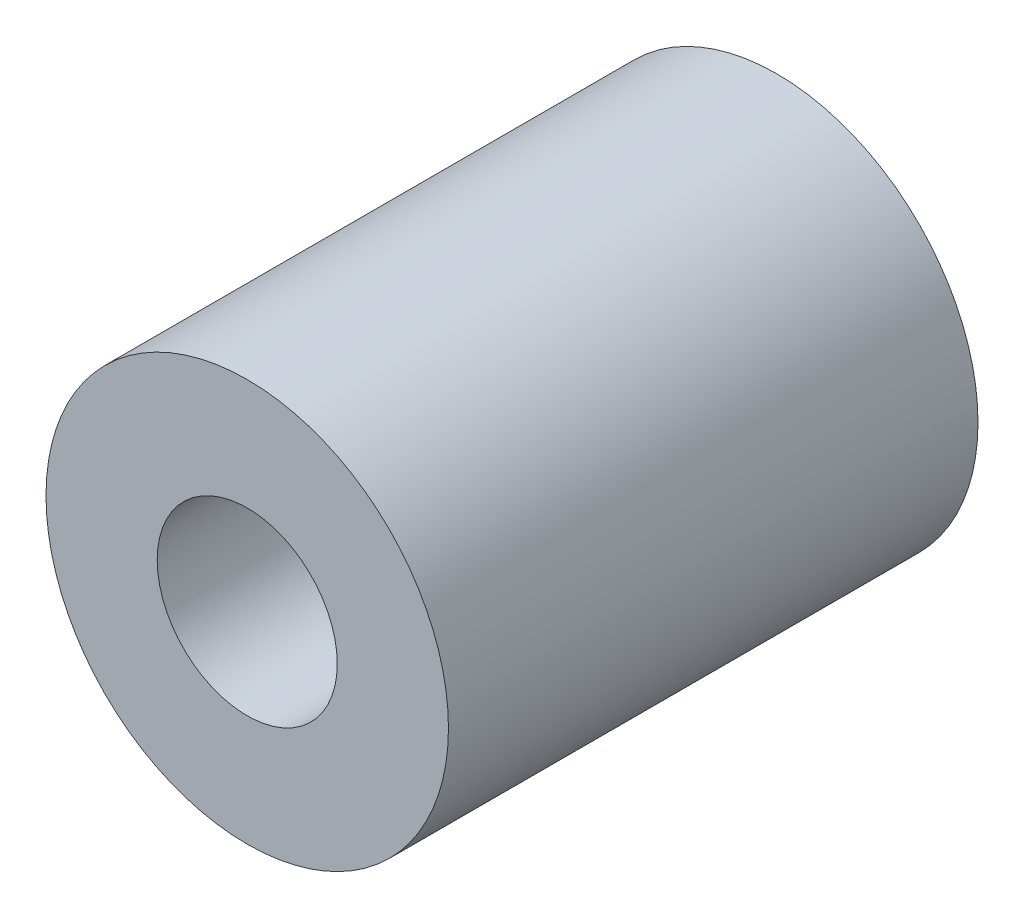
ISO-10303-21;
HEADER;
FILE_DESCRIPTION(('STEP AP214'),'2;1');
FILE_NAME('part.step','',(''),(''),'','','');
FILE_SCHEMA(('AUTOMOTIVE_DESIGN { 1 0 10303 214 1 1 1 1 }'));
ENDSEC;
DATA;
#1=APPLICATION_CONTEXT('core data for automotive mechanical design processes');
#2=APPLICATION_PROTOCOL_DEFINITION('international standard','automotive_design',2000,#1);
#3=PRODUCT_CONTEXT('',#1,'mechanical');
#4=PRODUCT('Part','Part','',(#3));
#5=PRODUCT_RELATED_PRODUCT_CATEGORY('part','',(#4));
#6=PRODUCT_DEFINITION_FORMATION('','',#4);
#7=PRODUCT_DEFINITION_CONTEXT('part definition',#1,'design');
#8=PRODUCT_DEFINITION('design','',#6,#7);
#9=PRODUCT_DEFINITION_SHAPE('','',#8);
#10=(LENGTH_UNIT() NAMED_UNIT(*) SI_UNIT(.MILLI.,.METRE.));
#11=(NAMED_UNIT(*) PLANE_ANGLE_UNIT() SI_UNIT($,.RADIAN.));
#12=(NAMED_UNIT(*) SI_UNIT($,.STERADIAN.) SOLID_ANGLE_UNIT());
#13=UNCERTAINTY_MEASURE_WITH_UNIT(LENGTH_MEASURE(1.E-05),#10,'distance_accuracy_value','');
#14=(GEOMETRIC_REPRESENTATION_CONTEXT(3) GLOBAL_UNCERTAINTY_ASSIGNED_CONTEXT((#13)) GLOBAL_UNIT_ASSIGNED_CONTEXT((#10,
#11,#12)) REPRESENTATION_CONTEXT('',''));
#15=CARTESIAN_POINT('',(0.,0.,0.));
#16=DIRECTION('',(0.,0.,1.));
#17=DIRECTION('',(1.,0.,0.));
#18=AXIS2_PLACEMENT_3D('',#15,#16,#17);
#19=CARTESIAN_POINT('',(0.,0.,25.));
#20=DIRECTION('',(0.,0.,-1.));
#21=DIRECTION('',(-1.,0.,0.));
#22=AXIS2_PLACEMENT_3D('',#19,#20,#21);
#23=CYLINDRICAL_SURFACE('',#22,9.5);
#24=CARTESIAN_POINT('',(0.,0.,25.));
#25=DIRECTION('',(0.,0.,1.));
#26=DIRECTION('',(1.,0.,0.));
#27=AXIS2_PLACEMENT_3D('',#24,#25,#26);
#28=CIRCLE('',#27,9.5);
#29=CARTESIAN_POINT('',(9.5,0.,25.));
#30=VERTEX_POINT('',#29);
#31=EDGE_CURVE('E10',#30,#30,#28,.T.);
#32=ORIENTED_EDGE('',*,*,#31,.F.);
#33=EDGE_LOOP('',(#32));
#34=FACE_BOUND('',#33,.T.);
#35=CARTESIAN_POINT('',(0.,0.,0.));
#36=DIRECTION('',(0.,0.,1.));
#37=DIRECTION('',(1.,0.,0.));
#38=AXIS2_PLACEMENT_3D('',#35,#36,#37);
#39=CIRCLE('',#38,9.5);
#40=CARTESIAN_POINT('',(9.5,0.,0.));
#41=VERTEX_POINT('',#40);
#42=EDGE_CURVE('E35',#41,#41,#39,.T.);
#43=ORIENTED_EDGE('',*,*,#42,.T.);
#44=EDGE_LOOP('',(#43));
#45=FACE_BOUND('',#44,.T.);
#46=ADVANCED_FACE('F32',(#34,#45),#23,.T.);
#47=CARTESIAN_POINT('',(0.,0.,25.));
#48=DIRECTION('',(0.,0.,1.));
#49=DIRECTION('',(1.,0.,0.));
#50=AXIS2_PLACEMENT_3D('',#47,#48,#49);
#51=PLANE('',#50);
#52=CARTESIAN_POINT('',(0.,0.,25.));
#53=DIRECTION('',(0.,0.,1.));
#54=DIRECTION('',(1.,0.,0.));
#55=AXIS2_PLACEMENT_3D('',#52,#53,#54);
#56=CIRCLE('',#55,4.25);
#57=CARTESIAN_POINT('',(4.25,0.,25.));
#58=VERTEX_POINT('',#57);
#59=EDGE_CURVE('E44',#58,#58,#56,.T.);
#60=ORIENTED_EDGE('',*,*,#59,.F.);
#61=EDGE_LOOP('',(#60));
#62=FACE_BOUND('',#61,.T.);
#63=ORIENTED_EDGE('',*,*,#31,.T.);
#64=EDGE_LOOP('',(#63));
#65=FACE_BOUND('',#64,.T.);
#66=ADVANCED_FACE('F59',(#62,#65),#51,.T.);
#67=CARTESIAN_POINT('',(0.,0.,0.));
#68=DIRECTION('',(0.,0.,1.));
#69=DIRECTION('',(1.,0.,0.));
#70=AXIS2_PLACEMENT_3D('',#67,#68,#69);
#71=PLANE('',#70);
#72=CARTESIAN_POINT('',(0.,0.,0.));
#73=DIRECTION('',(0.,0.,1.));
#74=DIRECTION('',(1.,0.,0.));
#75=AXIS2_PLACEMENT_3D('',#72,#73,#74);
#76=CIRCLE('',#75,4.25);
#77=CARTESIAN_POINT('',(4.25,0.,0.));
#78=VERTEX_POINT('',#77);
#79=EDGE_CURVE('E42',#78,#78,#76,.T.);
#80=ORIENTED_EDGE('',*,*,#79,.T.);
#81=EDGE_LOOP('',(#80));
#82=FACE_BOUND('',#81,.T.);
#83=ORIENTED_EDGE('',*,*,#42,.F.);
#84=EDGE_LOOP('',(#83));
#85=FACE_BOUND('',#84,.T.);
#86=ADVANCED_FACE('F50',(#82,#85),#71,.F.);
#87=CARTESIAN_POINT('',(0.,0.,0.));
#88=DIRECTION('',(0.,0.,1.));
#89=DIRECTION('',(1.,0.,0.));
#90=AXIS2_PLACEMENT_3D('',#87,#88,#89);
#91=CYLINDRICAL_SURFACE('',#90,4.25);
#92=ORIENTED_EDGE('',*,*,#79,.F.);
#93=EDGE_LOOP('',(#92));
#94=FACE_BOUND('',#93,.T.);
#95=ORIENTED_EDGE('',*,*,#59,.T.);
#96=EDGE_LOOP('',(#95));
#97=FACE_BOUND('',#96,.T.);
#98=ADVANCED_FACE('F53',(#94,#97),#91,.F.);
#99=CLOSED_SHELL('',(#46,#66,#86,#98));
#100=MANIFOLD_SOLID_BREP('B2',#99);
#101=ADVANCED_BREP_SHAPE_REPRESENTATION('',(#18,#100),#14);
#102=SHAPE_DEFINITION_REPRESENTATION(#9,#101);
ENDSEC;
END-ISO-10303-21;
